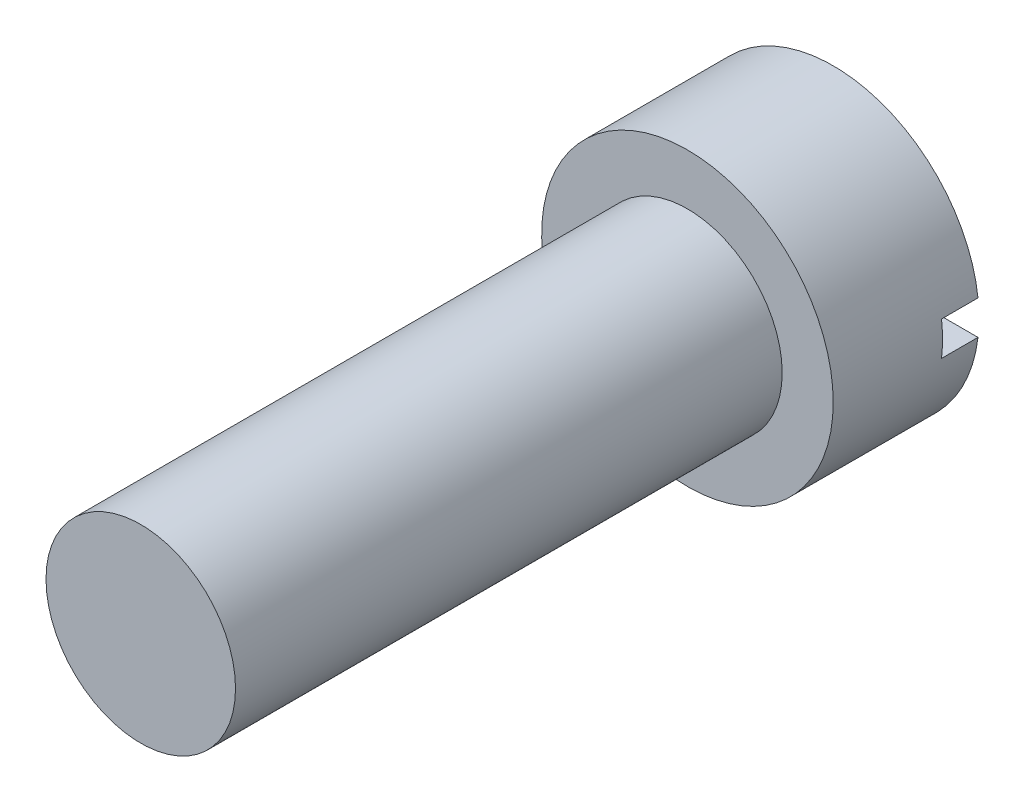
ISO-10303-21;
HEADER;
FILE_DESCRIPTION(('STEP AP214'),'2;1');
FILE_NAME('part.step','',(''),(''),'','','');
FILE_SCHEMA(('AUTOMOTIVE_DESIGN { 1 0 10303 214 1 1 1 1 }'));
ENDSEC;
DATA;
#1=APPLICATION_CONTEXT('core data for automotive mechanical design processes');
#2=APPLICATION_PROTOCOL_DEFINITION('international standard','automotive_design',2000,#1);
#3=PRODUCT_CONTEXT('',#1,'mechanical');
#4=PRODUCT('Part','Part','',(#3));
#5=PRODUCT_RELATED_PRODUCT_CATEGORY('part','',(#4));
#6=PRODUCT_DEFINITION_FORMATION('','',#4);
#7=PRODUCT_DEFINITION_CONTEXT('part definition',#1,'design');
#8=PRODUCT_DEFINITION('design','',#6,#7);
#9=PRODUCT_DEFINITION_SHAPE('','',#8);
#10=(LENGTH_UNIT() NAMED_UNIT(*) SI_UNIT(.MILLI.,.METRE.));
#11=(NAMED_UNIT(*) PLANE_ANGLE_UNIT() SI_UNIT($,.RADIAN.));
#12=(NAMED_UNIT(*) SI_UNIT($,.STERADIAN.) SOLID_ANGLE_UNIT());
#13=UNCERTAINTY_MEASURE_WITH_UNIT(LENGTH_MEASURE(1.E-05),#10,'distance_accuracy_value','');
#14=(GEOMETRIC_REPRESENTATION_CONTEXT(3) GLOBAL_UNCERTAINTY_ASSIGNED_CONTEXT((#13)) GLOBAL_UNIT_ASSIGNED_CONTEXT((#10,
#11,#12)) REPRESENTATION_CONTEXT('',''));
#15=CARTESIAN_POINT('',(0.,0.,0.));
#16=DIRECTION('',(0.,0.,1.));
#17=DIRECTION('',(1.,0.,0.));
#18=AXIS2_PLACEMENT_3D('',#15,#16,#17);
#19=CARTESIAN_POINT('',(0.,0.,0.));
#20=DIRECTION('',(0.,0.,1.));
#21=DIRECTION('',(1.,0.,0.));
#22=AXIS2_PLACEMENT_3D('',#19,#20,#21);
#23=PLANE('',#22);
#24=CARTESIAN_POINT('',(0.,0.,0.));
#25=DIRECTION('',(0.,0.,1.));
#26=DIRECTION('',(1.,0.,0.));
#27=AXIS2_PLACEMENT_3D('',#24,#25,#26);
#28=CIRCLE('',#27,2.);
#29=CARTESIAN_POINT('',(-1.9862298325671,-0.234288395402948,0.));
#30=VERTEX_POINT('',#29);
#31=CARTESIAN_POINT('',(1.9862298325671,-0.234288395402948,0.));
#32=VERTEX_POINT('',#31);
#33=EDGE_CURVE('E94',#30,#32,#28,.T.);
#34=ORIENTED_EDGE('',*,*,#33,.F.);
#35=DIRECTION('',(1.,0.,0.));
#36=VECTOR('',#35,1.);
#37=CARTESIAN_POINT('',(0.,-0.234288395402948,0.));
#38=LINE('',#37,#36);
#39=EDGE_CURVE('E83',#30,#32,#38,.T.);
#40=ORIENTED_EDGE('',*,*,#39,.T.);
#41=EDGE_LOOP('',(#34,#40));
#42=FACE_BOUND('',#41,.T.);
#43=ADVANCED_FACE('F35',(#42),#23,.F.);
#44=CARTESIAN_POINT('',(0.,0.,2.));
#45=DIRECTION('',(0.,0.,-1.));
#46=DIRECTION('',(-1.,0.,0.));
#47=AXIS2_PLACEMENT_3D('',#44,#45,#46);
#48=CYLINDRICAL_SURFACE('',#47,2.);
#49=CARTESIAN_POINT('',(0.,0.,0.5));
#50=DIRECTION('',(0.,0.,1.));
#51=DIRECTION('',(1.,0.,0.));
#52=AXIS2_PLACEMENT_3D('',#49,#50,#51);
#53=CIRCLE('',#52,2.);
#54=CARTESIAN_POINT('',(-1.9862298325671,0.234288395402948,0.5));
#55=VERTEX_POINT('',#54);
#56=CARTESIAN_POINT('',(-1.9862298325671,-0.234288395402948,0.5));
#57=VERTEX_POINT('',#56);
#58=EDGE_CURVE('E11',#55,#57,#53,.T.);
#59=ORIENTED_EDGE('',*,*,#58,.T.);
#60=DIRECTION('',(0.,0.,-1.));
#61=VECTOR('',#60,1.);
#62=CARTESIAN_POINT('',(-1.9862298325671,-0.234288395402948,2.));
#63=LINE('',#62,#61);
#64=EDGE_CURVE('E58',#57,#30,#63,.T.);
#65=ORIENTED_EDGE('',*,*,#64,.T.);
#66=ORIENTED_EDGE('',*,*,#33,.T.);
#67=DIRECTION('',(0.,0.,-1.));
#68=VECTOR('',#67,1.);
#69=CARTESIAN_POINT('',(1.9862298325671,-0.234288395402948,2.));
#70=LINE('',#69,#68);
#71=CARTESIAN_POINT('',(1.9862298325671,-0.234288395402948,0.5));
#72=VERTEX_POINT('',#71);
#73=EDGE_CURVE('E91',#32,#72,#70,.F.);
#74=ORIENTED_EDGE('',*,*,#73,.T.);
#75=CARTESIAN_POINT('',(1.9862298325671,0.234288395402948,0.5));
#76=VERTEX_POINT('',#75);
#77=EDGE_CURVE('E39',#72,#76,#53,.T.);
#78=ORIENTED_EDGE('',*,*,#77,.T.);
#79=DIRECTION('',(0.,0.,-1.));
#80=VECTOR('',#79,1.);
#81=CARTESIAN_POINT('',(1.9862298325671,0.234288395402948,2.));
#82=LINE('',#81,#80);
#83=CARTESIAN_POINT('',(1.9862298325671,0.234288395402948,0.));
#84=VERTEX_POINT('',#83);
#85=EDGE_CURVE('E78',#76,#84,#82,.T.);
#86=ORIENTED_EDGE('',*,*,#85,.T.);
#87=CARTESIAN_POINT('',(-1.9862298325671,0.234288395402948,0.));
#88=VERTEX_POINT('',#87);
#89=EDGE_CURVE('E89',#84,#88,#28,.T.);
#90=ORIENTED_EDGE('',*,*,#89,.T.);
#91=DIRECTION('',(0.,0.,-1.));
#92=VECTOR('',#91,1.);
#93=CARTESIAN_POINT('',(-1.9862298325671,0.234288395402948,2.));
#94=LINE('',#93,#92);
#95=EDGE_CURVE('E50',#88,#55,#94,.F.);
#96=ORIENTED_EDGE('',*,*,#95,.T.);
#97=EDGE_LOOP('',(#59,#65,#66,#74,#78,#86,#90,#96));
#98=FACE_BOUND('',#97,.T.);
#99=CARTESIAN_POINT('',(0.,0.,2.));
#100=DIRECTION('',(0.,0.,1.));
#101=DIRECTION('',(1.,0.,0.));
#102=AXIS2_PLACEMENT_3D('',#99,#100,#101);
#103=CIRCLE('',#102,2.);
#104=CARTESIAN_POINT('',(2.,0.,2.));
#105=VERTEX_POINT('',#104);
#106=EDGE_CURVE('E84',#105,#105,#103,.T.);
#107=ORIENTED_EDGE('',*,*,#106,.F.);
#108=EDGE_LOOP('',(#107));
#109=FACE_BOUND('',#108,.T.);
#110=ADVANCED_FACE('F37',(#98,#109),#48,.T.);
#111=CARTESIAN_POINT('',(0.,0.,2.));
#112=DIRECTION('',(0.,0.,1.));
#113=DIRECTION('',(1.,0.,0.));
#114=AXIS2_PLACEMENT_3D('',#111,#112,#113);
#115=PLANE('',#114);
#116=CARTESIAN_POINT('',(0.,0.,2.));
#117=DIRECTION('',(0.,0.,1.));
#118=DIRECTION('',(1.,0.,0.));
#119=AXIS2_PLACEMENT_3D('',#116,#117,#118);
#120=CIRCLE('',#119,1.3);
#121=CARTESIAN_POINT('',(1.3,0.,2.));
#122=VERTEX_POINT('',#121);
#123=EDGE_CURVE('E104',#122,#122,#120,.T.);
#124=ORIENTED_EDGE('',*,*,#123,.F.);
#125=EDGE_LOOP('',(#124));
#126=FACE_BOUND('',#125,.T.);
#127=ORIENTED_EDGE('',*,*,#106,.T.);
#128=EDGE_LOOP('',(#127));
#129=FACE_BOUND('',#128,.T.);
#130=ADVANCED_FACE('F120',(#126,#129),#115,.T.);
#131=ORIENTED_EDGE('',*,*,#89,.F.);
#132=DIRECTION('',(-1.,0.,0.));
#133=VECTOR('',#132,1.);
#134=CARTESIAN_POINT('',(0.,0.234288395402948,0.));
#135=LINE('',#134,#133);
#136=EDGE_CURVE('E75',#84,#88,#135,.T.);
#137=ORIENTED_EDGE('',*,*,#136,.T.);
#138=EDGE_LOOP('',(#131,#137));
#139=FACE_BOUND('',#138,.T.);
#140=ADVANCED_FACE('F93',(#139),#23,.F.);
#141=CARTESIAN_POINT('',(0.,0.,9.5));
#142=DIRECTION('',(0.,0.,-1.));
#143=DIRECTION('',(-1.,0.,0.));
#144=AXIS2_PLACEMENT_3D('',#141,#142,#143);
#145=CYLINDRICAL_SURFACE('',#144,1.3);
#146=CARTESIAN_POINT('',(0.,0.,9.5));
#147=DIRECTION('',(0.,0.,1.));
#148=DIRECTION('',(1.,0.,0.));
#149=AXIS2_PLACEMENT_3D('',#146,#147,#148);
#150=CIRCLE('',#149,1.3);
#151=CARTESIAN_POINT('',(1.3,0.,9.5));
#152=VERTEX_POINT('',#151);
#153=EDGE_CURVE('E99',#152,#152,#150,.T.);
#154=ORIENTED_EDGE('',*,*,#153,.F.);
#155=EDGE_LOOP('',(#154));
#156=FACE_BOUND('',#155,.T.);
#157=ORIENTED_EDGE('',*,*,#123,.T.);
#158=EDGE_LOOP('',(#157));
#159=FACE_BOUND('',#158,.T.);
#160=ADVANCED_FACE('F114',(#156,#159),#145,.T.);
#161=CARTESIAN_POINT('',(0.,0.,9.5));
#162=DIRECTION('',(0.,0.,1.));
#163=DIRECTION('',(1.,0.,0.));
#164=AXIS2_PLACEMENT_3D('',#161,#162,#163);
#165=PLANE('',#164);
#166=ORIENTED_EDGE('',*,*,#153,.T.);
#167=EDGE_LOOP('',(#166));
#168=FACE_BOUND('',#167,.T.);
#169=ADVANCED_FACE('F112',(#168),#165,.T.);
#170=CARTESIAN_POINT('',(0.,0.,0.5));
#171=DIRECTION('',(0.,0.,1.));
#172=DIRECTION('',(1.,0.,0.));
#173=AXIS2_PLACEMENT_3D('',#170,#171,#172);
#174=PLANE('',#173);
#175=DIRECTION('',(1.,0.,0.));
#176=VECTOR('',#175,1.);
#177=CARTESIAN_POINT('',(2.52767480110751,0.234288395402948,0.5));
#178=LINE('',#177,#176);
#179=EDGE_CURVE('E196',#55,#76,#178,.T.);
#180=ORIENTED_EDGE('',*,*,#179,.T.);
#181=ORIENTED_EDGE('',*,*,#77,.F.);
#182=DIRECTION('',(-1.,0.,0.));
#183=VECTOR('',#182,1.);
#184=CARTESIAN_POINT('',(2.52767480110751,-0.234288395402948,0.5));
#185=LINE('',#184,#183);
#186=EDGE_CURVE('E195',#72,#57,#185,.T.);
#187=ORIENTED_EDGE('',*,*,#186,.T.);
#188=ORIENTED_EDGE('',*,*,#58,.F.);
#189=EDGE_LOOP('',(#180,#181,#187,#188));
#190=FACE_BOUND('',#189,.T.);
#191=ADVANCED_FACE('F138',(#190),#174,.F.);
#192=CARTESIAN_POINT('',(2.52767480110751,-0.234288395402948,0.5));
#193=DIRECTION('',(0.,-1.,0.));
#194=DIRECTION('',(0.,0.,-1.));
#195=AXIS2_PLACEMENT_3D('',#192,#193,#194);
#196=PLANE('',#195);
#197=ORIENTED_EDGE('',*,*,#186,.F.);
#198=ORIENTED_EDGE('',*,*,#73,.F.);
#199=ORIENTED_EDGE('',*,*,#39,.F.);
#200=ORIENTED_EDGE('',*,*,#64,.F.);
#201=EDGE_LOOP('',(#197,#198,#199,#200));
#202=FACE_BOUND('',#201,.T.);
#203=ADVANCED_FACE('F143',(#202),#196,.F.);
#204=CARTESIAN_POINT('',(2.52767480110751,0.234288395402948,0.5));
#205=DIRECTION('',(0.,1.,0.));
#206=DIRECTION('',(0.,0.,1.));
#207=AXIS2_PLACEMENT_3D('',#204,#205,#206);
#208=PLANE('',#207);
#209=ORIENTED_EDGE('',*,*,#179,.F.);
#210=ORIENTED_EDGE('',*,*,#95,.F.);
#211=ORIENTED_EDGE('',*,*,#136,.F.);
#212=ORIENTED_EDGE('',*,*,#85,.F.);
#213=EDGE_LOOP('',(#209,#210,#211,#212));
#214=FACE_BOUND('',#213,.T.);
#215=ADVANCED_FACE('F77',(#214),#208,.F.);
#216=CLOSED_SHELL('',(#43,#110,#130,#140,#160,#169,#191,#203,#215));
#217=MANIFOLD_SOLID_BREP('B2',#216);
#218=ADVANCED_BREP_SHAPE_REPRESENTATION('',(#18,#217),#14);
#219=SHAPE_DEFINITION_REPRESENTATION(#9,#218);
ENDSEC;
END-ISO-10303-21;
